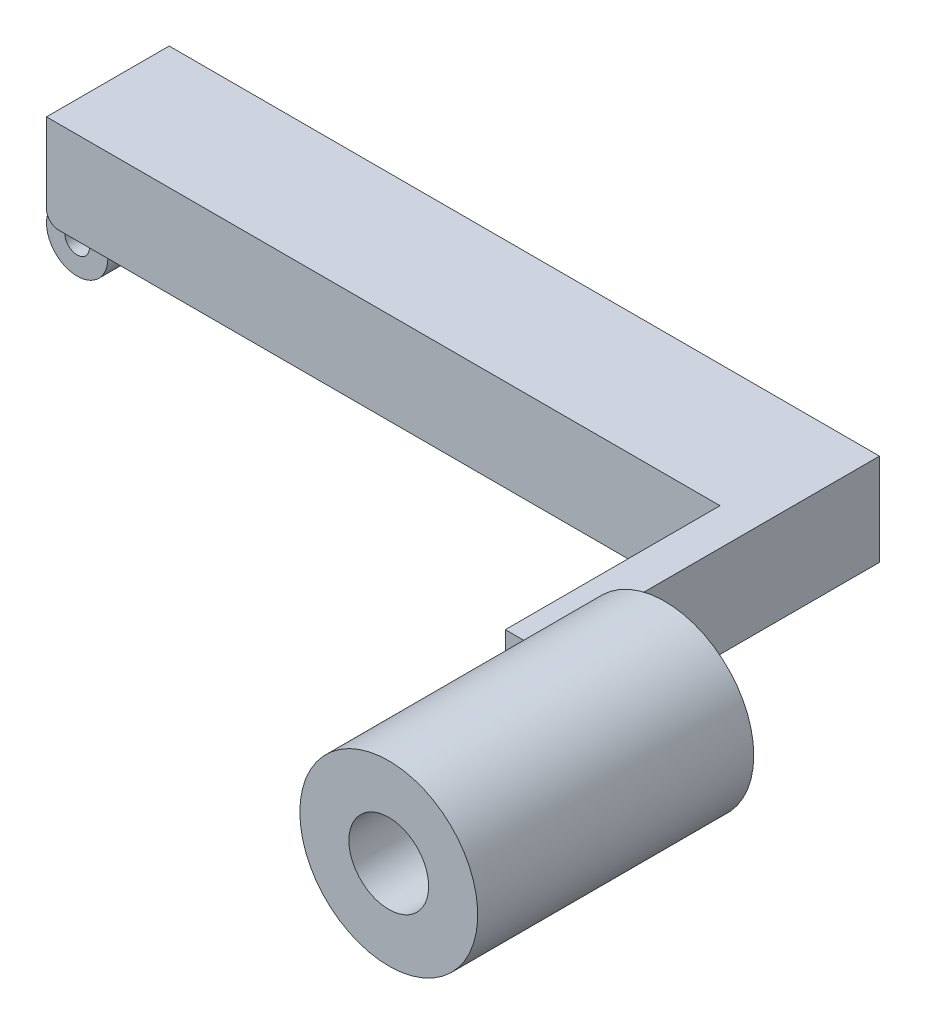
ISO-10303-21;
HEADER;
FILE_DESCRIPTION(('STEP AP214'),'2;1');
FILE_NAME('part.step','',(''),(''),'','','');
FILE_SCHEMA(('AUTOMOTIVE_DESIGN { 1 0 10303 214 1 1 1 1 }'));
ENDSEC;
DATA;
#1=APPLICATION_CONTEXT('core data for automotive mechanical design processes');
#2=APPLICATION_PROTOCOL_DEFINITION('international standard','automotive_design',2000,#1);
#3=PRODUCT_CONTEXT('',#1,'mechanical');
#4=PRODUCT('Part','Part','',(#3));
#5=PRODUCT_RELATED_PRODUCT_CATEGORY('part','',(#4));
#6=PRODUCT_DEFINITION_FORMATION('','',#4);
#7=PRODUCT_DEFINITION_CONTEXT('part definition',#1,'design');
#8=PRODUCT_DEFINITION('design','',#6,#7);
#9=PRODUCT_DEFINITION_SHAPE('','',#8);
#10=(LENGTH_UNIT() NAMED_UNIT(*) SI_UNIT(.MILLI.,.METRE.));
#11=(NAMED_UNIT(*) PLANE_ANGLE_UNIT() SI_UNIT($,.RADIAN.));
#12=(NAMED_UNIT(*) SI_UNIT($,.STERADIAN.) SOLID_ANGLE_UNIT());
#13=UNCERTAINTY_MEASURE_WITH_UNIT(LENGTH_MEASURE(1.E-05),#10,'distance_accuracy_value','');
#14=(GEOMETRIC_REPRESENTATION_CONTEXT(3) GLOBAL_UNCERTAINTY_ASSIGNED_CONTEXT((#13)) GLOBAL_UNIT_ASSIGNED_CONTEXT((#10,
#11,#12)) REPRESENTATION_CONTEXT('',''));
#15=CARTESIAN_POINT('',(0.,0.,0.));
#16=DIRECTION('',(0.,0.,1.));
#17=DIRECTION('',(1.,0.,0.));
#18=AXIS2_PLACEMENT_3D('',#15,#16,#17);
#19=CARTESIAN_POINT('',(0.,-12.5,5.));
#20=DIRECTION('',(0.,0.,-1.));
#21=DIRECTION('',(-1.,0.,0.));
#22=AXIS2_PLACEMENT_3D('',#19,#20,#21);
#23=CYLINDRICAL_SURFACE('',#22,2.);
#24=CARTESIAN_POINT('',(0.,-12.5,5.));
#25=DIRECTION('',(0.,0.,-1.));
#26=DIRECTION('',(-1.,0.,0.));
#27=AXIS2_PLACEMENT_3D('',#24,#25,#26);
#28=CIRCLE('',#27,2.);
#29=CARTESIAN_POINT('',(-2.,-12.5,5.));
#30=VERTEX_POINT('',#29);
#31=EDGE_CURVE('E179',#30,#30,#28,.T.);
#32=ORIENTED_EDGE('',*,*,#31,.F.);
#33=EDGE_LOOP('',(#32));
#34=FACE_BOUND('',#33,.T.);
#35=CARTESIAN_POINT('',(0.,-12.5,-5.));
#36=DIRECTION('',(0.,0.,-1.));
#37=DIRECTION('',(-1.,0.,0.));
#38=AXIS2_PLACEMENT_3D('',#35,#36,#37);
#39=CIRCLE('',#38,2.);
#40=CARTESIAN_POINT('',(-2.,-12.5,-5.));
#41=VERTEX_POINT('',#40);
#42=EDGE_CURVE('E20',#41,#41,#39,.T.);
#43=ORIENTED_EDGE('',*,*,#42,.T.);
#44=EDGE_LOOP('',(#43));
#45=FACE_BOUND('',#44,.T.);
#46=ADVANCED_FACE('F17',(#34,#45),#23,.F.);
#47=CARTESIAN_POINT('',(5.,-12.5,5.));
#48=DIRECTION('',(-1.,0.,0.));
#49=DIRECTION('',(0.,-1.,0.));
#50=AXIS2_PLACEMENT_3D('',#47,#48,#49);
#51=PLANE('',#50);
#52=DIRECTION('',(0.,0.,1.));
#53=VECTOR('',#52,1.);
#54=CARTESIAN_POINT('',(5.,-7.5,10.));
#55=LINE('',#54,#53);
#56=CARTESIAN_POINT('',(5.,-7.5,-5.));
#57=VERTEX_POINT('',#56);
#58=CARTESIAN_POINT('',(5.,-7.5,5.));
#59=VERTEX_POINT('',#58);
#60=EDGE_CURVE('E140',#57,#59,#55,.T.);
#61=ORIENTED_EDGE('',*,*,#60,.T.);
#62=DIRECTION('',(0.,1.,0.));
#63=VECTOR('',#62,1.);
#64=CARTESIAN_POINT('',(5.,-12.5,5.));
#65=LINE('',#64,#63);
#66=CARTESIAN_POINT('',(5.,-12.5,5.));
#67=VERTEX_POINT('',#66);
#68=EDGE_CURVE('E182',#67,#59,#65,.T.);
#69=ORIENTED_EDGE('',*,*,#68,.F.);
#70=DIRECTION('',(0.,0.,1.));
#71=VECTOR('',#70,1.);
#72=CARTESIAN_POINT('',(5.,-12.5,5.));
#73=LINE('',#72,#71);
#74=CARTESIAN_POINT('',(5.,-12.5,-5.));
#75=VERTEX_POINT('',#74);
#76=EDGE_CURVE('E121',#75,#67,#73,.T.);
#77=ORIENTED_EDGE('',*,*,#76,.F.);
#78=DIRECTION('',(0.,1.,0.));
#79=VECTOR('',#78,1.);
#80=CARTESIAN_POINT('',(5.,-12.5,-5.));
#81=LINE('',#80,#79);
#82=EDGE_CURVE('E106',#75,#57,#81,.T.);
#83=ORIENTED_EDGE('',*,*,#82,.T.);
#84=EDGE_LOOP('',(#61,#69,#77,#83));
#85=FACE_BOUND('',#84,.T.);
#86=ADVANCED_FACE('F302',(#85),#51,.F.);
#87=CARTESIAN_POINT('',(0.,-12.5,-5.));
#88=DIRECTION('',(0.,0.,1.));
#89=DIRECTION('',(1.,0.,0.));
#90=AXIS2_PLACEMENT_3D('',#87,#88,#89);
#91=PLANE('',#90);
#92=ORIENTED_EDGE('',*,*,#42,.F.);
#93=EDGE_LOOP('',(#92));
#94=FACE_BOUND('',#93,.T.);
#95=DIRECTION('',(0.,1.,0.));
#96=VECTOR('',#95,1.);
#97=CARTESIAN_POINT('',(0.,0.,-5.));
#98=LINE('',#97,#96);
#99=CARTESIAN_POINT('',(0.,-5.5,-5.));
#100=VERTEX_POINT('',#99);
#101=CARTESIAN_POINT('',(0.,-7.5,-5.));
#102=VERTEX_POINT('',#101);
#103=EDGE_CURVE('E89',#100,#102,#98,.F.);
#104=ORIENTED_EDGE('',*,*,#103,.F.);
#105=CARTESIAN_POINT('',(2.,-5.5,-5.));
#106=DIRECTION('',(0.,0.,1.));
#107=DIRECTION('',(1.,0.,0.));
#108=AXIS2_PLACEMENT_3D('',#105,#106,#107);
#109=CIRCLE('',#108,2.);
#110=CARTESIAN_POINT('',(2.00000000000002,-7.5,-5.));
#111=VERTEX_POINT('',#110);
#112=EDGE_CURVE('E143',#111,#100,#109,.F.);
#113=ORIENTED_EDGE('',*,*,#112,.F.);
#114=DIRECTION('',(1.,0.,0.));
#115=VECTOR('',#114,1.);
#116=CARTESIAN_POINT('',(115.8,-7.5,-5.));
#117=LINE('',#116,#115);
#118=EDGE_CURVE('E135',#111,#57,#117,.T.);
#119=ORIENTED_EDGE('',*,*,#118,.T.);
#120=ORIENTED_EDGE('',*,*,#82,.F.);
#121=CARTESIAN_POINT('',(0.,-12.5,-5.));
#122=DIRECTION('',(0.,0.,-1.));
#123=DIRECTION('',(-1.,0.,0.));
#124=AXIS2_PLACEMENT_3D('',#121,#122,#123);
#125=CIRCLE('',#124,5.);
#126=EDGE_CURVE('E102',#102,#75,#125,.F.);
#127=ORIENTED_EDGE('',*,*,#126,.F.);
#128=EDGE_LOOP('',(#104,#113,#119,#120,#127));
#129=FACE_BOUND('',#128,.T.);
#130=ADVANCED_FACE('F103',(#94,#129),#91,.F.);
#131=CARTESIAN_POINT('',(0.,-12.5,5.));
#132=DIRECTION('',(0.,0.,-1.));
#133=DIRECTION('',(-1.,0.,0.));
#134=AXIS2_PLACEMENT_3D('',#131,#132,#133);
#135=CYLINDRICAL_SURFACE('',#134,5.);
#136=DIRECTION('',(0.,0.,1.));
#137=VECTOR('',#136,1.);
#138=CARTESIAN_POINT('',(0.,-7.5,0.));
#139=LINE('',#138,#137);
#140=CARTESIAN_POINT('',(0.,-7.5,5.));
#141=VERTEX_POINT('',#140);
#142=EDGE_CURVE('E94',#102,#141,#139,.T.);
#143=ORIENTED_EDGE('',*,*,#142,.F.);
#144=ORIENTED_EDGE('',*,*,#126,.T.);
#145=ORIENTED_EDGE('',*,*,#76,.T.);
#146=CARTESIAN_POINT('',(0.,-12.5,5.));
#147=DIRECTION('',(0.,0.,-1.));
#148=DIRECTION('',(-1.,0.,0.));
#149=AXIS2_PLACEMENT_3D('',#146,#147,#148);
#150=CIRCLE('',#149,5.);
#151=EDGE_CURVE('E110',#141,#67,#150,.F.);
#152=ORIENTED_EDGE('',*,*,#151,.F.);
#153=EDGE_LOOP('',(#143,#144,#145,#152));
#154=FACE_BOUND('',#153,.T.);
#155=ADVANCED_FACE('F111',(#154),#135,.T.);
#156=CARTESIAN_POINT('',(0.,-12.5,5.));
#157=DIRECTION('',(0.,0.,1.));
#158=DIRECTION('',(1.,0.,0.));
#159=AXIS2_PLACEMENT_3D('',#156,#157,#158);
#160=PLANE('',#159);
#161=ORIENTED_EDGE('',*,*,#31,.T.);
#162=EDGE_LOOP('',(#161));
#163=FACE_BOUND('',#162,.T.);
#164=CARTESIAN_POINT('',(2.,-5.5,5.));
#165=DIRECTION('',(0.,0.,1.));
#166=DIRECTION('',(1.,0.,0.));
#167=AXIS2_PLACEMENT_3D('',#164,#165,#166);
#168=CIRCLE('',#167,2.);
#169=CARTESIAN_POINT('',(0.,-5.5,5.));
#170=VERTEX_POINT('',#169);
#171=CARTESIAN_POINT('',(2.,-7.5,5.));
#172=VERTEX_POINT('',#171);
#173=EDGE_CURVE('E177',#170,#172,#168,.T.);
#174=ORIENTED_EDGE('',*,*,#173,.F.);
#175=DIRECTION('',(0.,1.,0.));
#176=VECTOR('',#175,1.);
#177=CARTESIAN_POINT('',(0.,0.,5.));
#178=LINE('',#177,#176);
#179=EDGE_CURVE('E112',#141,#170,#178,.T.);
#180=ORIENTED_EDGE('',*,*,#179,.F.);
#181=ORIENTED_EDGE('',*,*,#151,.T.);
#182=ORIENTED_EDGE('',*,*,#68,.T.);
#183=DIRECTION('',(1.,0.,0.));
#184=VECTOR('',#183,1.);
#185=CARTESIAN_POINT('',(115.8,-7.5,5.));
#186=LINE('',#185,#184);
#187=EDGE_CURVE('E127',#59,#172,#186,.F.);
#188=ORIENTED_EDGE('',*,*,#187,.T.);
#189=EDGE_LOOP('',(#174,#180,#181,#182,#188));
#190=FACE_BOUND('',#189,.T.);
#191=ADVANCED_FACE('F335',(#163,#190),#160,.T.);
#192=CARTESIAN_POINT('',(2.,-5.5,10.));
#193=DIRECTION('',(0.,0.,1.));
#194=DIRECTION('',(1.,0.,0.));
#195=AXIS2_PLACEMENT_3D('',#192,#193,#194);
#196=CYLINDRICAL_SURFACE('',#195,2.);
#197=ORIENTED_EDGE('',*,*,#173,.T.);
#198=DIRECTION('',(0.,0.,1.));
#199=VECTOR('',#198,1.);
#200=CARTESIAN_POINT('',(2.,-7.5,10.));
#201=LINE('',#200,#199);
#202=CARTESIAN_POINT('',(2.,-7.5,10.));
#203=VERTEX_POINT('',#202);
#204=EDGE_CURVE('E124',#172,#203,#201,.T.);
#205=ORIENTED_EDGE('',*,*,#204,.T.);
#206=CARTESIAN_POINT('',(2.,-5.5,10.));
#207=DIRECTION('',(0.,0.,1.));
#208=DIRECTION('',(1.,0.,0.));
#209=AXIS2_PLACEMENT_3D('',#206,#207,#208);
#210=CIRCLE('',#209,2.);
#211=CARTESIAN_POINT('',(0.,-5.5,10.));
#212=VERTEX_POINT('',#211);
#213=EDGE_CURVE('E169',#203,#212,#210,.F.);
#214=ORIENTED_EDGE('',*,*,#213,.T.);
#215=DIRECTION('',(0.,0.,1.));
#216=VECTOR('',#215,1.);
#217=CARTESIAN_POINT('',(0.,-5.5,0.));
#218=LINE('',#217,#216);
#219=EDGE_CURVE('E114',#170,#212,#218,.T.);
#220=ORIENTED_EDGE('',*,*,#219,.F.);
#221=EDGE_LOOP('',(#197,#205,#214,#220));
#222=FACE_BOUND('',#221,.T.);
#223=ADVANCED_FACE('F336',(#222),#196,.T.);
#224=CARTESIAN_POINT('',(2.,-5.5,10.));
#225=DIRECTION('',(0.,0.,1.));
#226=DIRECTION('',(1.,0.,0.));
#227=AXIS2_PLACEMENT_3D('',#224,#225,#226);
#228=CYLINDRICAL_SURFACE('',#227,2.);
#229=CARTESIAN_POINT('',(2.,-5.5,-10.));
#230=DIRECTION('',(0.,0.,1.));
#231=DIRECTION('',(1.,0.,0.));
#232=AXIS2_PLACEMENT_3D('',#229,#230,#231);
#233=CIRCLE('',#232,2.);
#234=CARTESIAN_POINT('',(0.,-5.5,-10.));
#235=VERTEX_POINT('',#234);
#236=CARTESIAN_POINT('',(2.00000000000002,-7.5,-10.));
#237=VERTEX_POINT('',#236);
#238=EDGE_CURVE('E164',#235,#237,#233,.T.);
#239=ORIENTED_EDGE('',*,*,#238,.T.);
#240=DIRECTION('',(0.,0.,1.));
#241=VECTOR('',#240,1.);
#242=CARTESIAN_POINT('',(2.00000000000003,-7.5,10.));
#243=LINE('',#242,#241);
#244=EDGE_CURVE('E126',#237,#111,#243,.T.);
#245=ORIENTED_EDGE('',*,*,#244,.T.);
#246=ORIENTED_EDGE('',*,*,#112,.T.);
#247=DIRECTION('',(0.,0.,1.));
#248=VECTOR('',#247,1.);
#249=CARTESIAN_POINT('',(0.,-5.5,0.));
#250=LINE('',#249,#248);
#251=EDGE_CURVE('E97',#235,#100,#250,.T.);
#252=ORIENTED_EDGE('',*,*,#251,.F.);
#253=EDGE_LOOP('',(#239,#245,#246,#252));
#254=FACE_BOUND('',#253,.T.);
#255=ADVANCED_FACE('F304',(#254),#228,.T.);
#256=CARTESIAN_POINT('',(125.8,0.,80.));
#257=DIRECTION('',(0.,0.,-1.));
#258=DIRECTION('',(-1.,0.,0.));
#259=AXIS2_PLACEMENT_3D('',#256,#257,#258);
#260=CYLINDRICAL_SURFACE('',#259,6.50000000000002);
#261=CARTESIAN_POINT('',(125.8,0.,35.));
#262=DIRECTION('',(0.,0.,-1.));
#263=DIRECTION('',(-1.,0.,0.));
#264=AXIS2_PLACEMENT_3D('',#261,#262,#263);
#265=CIRCLE('',#264,6.50000000000002);
#266=CARTESIAN_POINT('',(119.3,0.,35.));
#267=VERTEX_POINT('',#266);
#268=EDGE_CURVE('E159',#267,#267,#265,.T.);
#269=ORIENTED_EDGE('',*,*,#268,.T.);
#270=EDGE_LOOP('',(#269));
#271=FACE_BOUND('',#270,.T.);
#272=CARTESIAN_POINT('',(125.8,0.,80.));
#273=DIRECTION('',(0.,0.,-1.));
#274=DIRECTION('',(-1.,0.,0.));
#275=AXIS2_PLACEMENT_3D('',#272,#273,#274);
#276=CIRCLE('',#275,6.50000000000002);
#277=CARTESIAN_POINT('',(119.3,0.,80.));
#278=VERTEX_POINT('',#277);
#279=EDGE_CURVE('E137',#278,#278,#276,.T.);
#280=ORIENTED_EDGE('',*,*,#279,.F.);
#281=EDGE_LOOP('',(#280));
#282=FACE_BOUND('',#281,.T.);
#283=ADVANCED_FACE('F344',(#271,#282),#260,.F.);
#284=CARTESIAN_POINT('',(115.8,-7.5,10.));
#285=DIRECTION('',(0.,1.,0.));
#286=DIRECTION('',(0.,0.,1.));
#287=AXIS2_PLACEMENT_3D('',#284,#285,#286);
#288=PLANE('',#287);
#289=ORIENTED_EDGE('',*,*,#244,.F.);
#290=DIRECTION('',(1.,0.,0.));
#291=VECTOR('',#290,1.);
#292=CARTESIAN_POINT('',(115.8,-7.5,-10.));
#293=LINE('',#292,#291);
#294=CARTESIAN_POINT('',(115.8,-7.5,-10.));
#295=VERTEX_POINT('',#294);
#296=EDGE_CURVE('E167',#237,#295,#293,.T.);
#297=ORIENTED_EDGE('',*,*,#296,.T.);
#298=DIRECTION('',(0.,0.,1.));
#299=VECTOR('',#298,1.);
#300=CARTESIAN_POINT('',(115.8,-7.5,0.));
#301=LINE('',#300,#299);
#302=CARTESIAN_POINT('',(115.8,-7.5,35.));
#303=VERTEX_POINT('',#302);
#304=EDGE_CURVE('E163',#295,#303,#301,.T.);
#305=ORIENTED_EDGE('',*,*,#304,.T.);
#306=DIRECTION('',(1.,0.,0.));
#307=VECTOR('',#306,1.);
#308=CARTESIAN_POINT('',(125.8,-7.5,35.));
#309=LINE('',#308,#307);
#310=CARTESIAN_POINT('',(113.390326354009,-7.5,35.));
#311=VERTEX_POINT('',#310);
#312=EDGE_CURVE('E162',#303,#311,#309,.F.);
#313=ORIENTED_EDGE('',*,*,#312,.T.);
#314=DIRECTION('',(0.,0.,-1.));
#315=VECTOR('',#314,1.);
#316=CARTESIAN_POINT('',(113.390326354009,-7.50000000000001,80.));
#317=LINE('',#316,#315);
#318=CARTESIAN_POINT('',(113.390326354009,-7.5,45.));
#319=VERTEX_POINT('',#318);
#320=EDGE_CURVE('E175',#319,#311,#317,.T.);
#321=ORIENTED_EDGE('',*,*,#320,.F.);
#322=DIRECTION('',(-1.,0.,0.));
#323=VECTOR('',#322,1.);
#324=CARTESIAN_POINT('',(0.,-7.5,45.));
#325=LINE('',#324,#323);
#326=CARTESIAN_POINT('',(109.8,-7.5,45.));
#327=VERTEX_POINT('',#326);
#328=EDGE_CURVE('E194',#319,#327,#325,.T.);
#329=ORIENTED_EDGE('',*,*,#328,.T.);
#330=DIRECTION('',(0.,0.,-1.));
#331=VECTOR('',#330,1.);
#332=CARTESIAN_POINT('',(109.8,-7.5,45.));
#333=LINE('',#332,#331);
#334=CARTESIAN_POINT('',(109.8,-7.5,10.));
#335=VERTEX_POINT('',#334);
#336=EDGE_CURVE('E128',#327,#335,#333,.T.);
#337=ORIENTED_EDGE('',*,*,#336,.T.);
#338=DIRECTION('',(-1.,0.,0.));
#339=VECTOR('',#338,1.);
#340=CARTESIAN_POINT('',(115.8,-7.5,10.));
#341=LINE('',#340,#339);
#342=EDGE_CURVE('E172',#335,#203,#341,.T.);
#343=ORIENTED_EDGE('',*,*,#342,.T.);
#344=ORIENTED_EDGE('',*,*,#204,.F.);
#345=ORIENTED_EDGE('',*,*,#187,.F.);
#346=ORIENTED_EDGE('',*,*,#60,.F.);
#347=ORIENTED_EDGE('',*,*,#118,.F.);
#348=EDGE_LOOP('',(#289,#297,#305,#313,#321,#329,#337,#343,#344,#345,#346,#347));
#349=FACE_BOUND('',#348,.T.);
#350=ADVANCED_FACE('F273',(#349),#288,.F.);
#351=CARTESIAN_POINT('',(125.8,0.,80.));
#352=DIRECTION('',(0.,0.,1.));
#353=DIRECTION('',(1.,0.,0.));
#354=AXIS2_PLACEMENT_3D('',#351,#352,#353);
#355=PLANE('',#354);
#356=ORIENTED_EDGE('',*,*,#279,.T.);
#357=EDGE_LOOP('',(#356));
#358=FACE_BOUND('',#357,.T.);
#359=CARTESIAN_POINT('',(125.8,0.,80.));
#360=DIRECTION('',(0.,0.,-1.));
#361=DIRECTION('',(-1.,0.,0.));
#362=AXIS2_PLACEMENT_3D('',#359,#360,#361);
#363=CIRCLE('',#362,14.5);
#364=CARTESIAN_POINT('',(111.3,0.,80.));
#365=VERTEX_POINT('',#364);
#366=EDGE_CURVE('E155',#365,#365,#363,.T.);
#367=ORIENTED_EDGE('',*,*,#366,.F.);
#368=EDGE_LOOP('',(#367));
#369=FACE_BOUND('',#368,.T.);
#370=ADVANCED_FACE('F369',(#358,#369),#355,.T.);
#371=CARTESIAN_POINT('',(0.,0.,45.));
#372=DIRECTION('',(0.,0.,-1.));
#373=DIRECTION('',(-1.,0.,0.));
#374=AXIS2_PLACEMENT_3D('',#371,#372,#373);
#375=PLANE('',#374);
#376=DIRECTION('',(1.,0.,0.));
#377=VECTOR('',#376,1.);
#378=CARTESIAN_POINT('',(115.8,7.5,45.));
#379=LINE('',#378,#377);
#380=CARTESIAN_POINT('',(113.390326354009,7.5,45.));
#381=VERTEX_POINT('',#380);
#382=CARTESIAN_POINT('',(109.8,7.5,45.));
#383=VERTEX_POINT('',#382);
#384=EDGE_CURVE('E153',#381,#383,#379,.F.);
#385=ORIENTED_EDGE('',*,*,#384,.T.);
#386=DIRECTION('',(0.,1.,0.));
#387=VECTOR('',#386,1.);
#388=CARTESIAN_POINT('',(109.8,7.5,45.));
#389=LINE('',#388,#387);
#390=EDGE_CURVE('E132',#383,#327,#389,.F.);
#391=ORIENTED_EDGE('',*,*,#390,.T.);
#392=ORIENTED_EDGE('',*,*,#328,.F.);
#393=CARTESIAN_POINT('',(125.8,0.,45.));
#394=DIRECTION('',(0.,0.,-1.));
#395=DIRECTION('',(-1.,0.,0.));
#396=AXIS2_PLACEMENT_3D('',#393,#394,#395);
#397=CIRCLE('',#396,14.5);
#398=EDGE_CURVE('E151',#381,#319,#397,.F.);
#399=ORIENTED_EDGE('',*,*,#398,.F.);
#400=EDGE_LOOP('',(#385,#391,#392,#399));
#401=FACE_BOUND('',#400,.T.);
#402=ADVANCED_FACE('F322',(#401),#375,.F.);
#403=CARTESIAN_POINT('',(109.8,7.5,45.));
#404=DIRECTION('',(1.,0.,0.));
#405=DIRECTION('',(0.,0.,-1.));
#406=AXIS2_PLACEMENT_3D('',#403,#404,#405);
#407=PLANE('',#406);
#408=ORIENTED_EDGE('',*,*,#336,.F.);
#409=ORIENTED_EDGE('',*,*,#390,.F.);
#410=DIRECTION('',(0.,0.,-1.));
#411=VECTOR('',#410,1.);
#412=CARTESIAN_POINT('',(109.8,7.5,10.));
#413=LINE('',#412,#411);
#414=CARTESIAN_POINT('',(109.8,7.5,10.));
#415=VERTEX_POINT('',#414);
#416=EDGE_CURVE('E208',#383,#415,#413,.T.);
#417=ORIENTED_EDGE('',*,*,#416,.T.);
#418=DIRECTION('',(0.,1.,0.));
#419=VECTOR('',#418,1.);
#420=CARTESIAN_POINT('',(109.8,-7.5,10.));
#421=LINE('',#420,#419);
#422=EDGE_CURVE('E131',#415,#335,#421,.F.);
#423=ORIENTED_EDGE('',*,*,#422,.T.);
#424=EDGE_LOOP('',(#408,#409,#417,#423));
#425=FACE_BOUND('',#424,.T.);
#426=ADVANCED_FACE('F326',(#425),#407,.F.);
#427=CARTESIAN_POINT('',(115.8,-7.5,10.));
#428=DIRECTION('',(0.,0.,-1.));
#429=DIRECTION('',(-1.,0.,0.));
#430=AXIS2_PLACEMENT_3D('',#427,#428,#429);
#431=PLANE('',#430);
#432=ORIENTED_EDGE('',*,*,#213,.F.);
#433=ORIENTED_EDGE('',*,*,#342,.F.);
#434=ORIENTED_EDGE('',*,*,#422,.F.);
#435=DIRECTION('',(1.,0.,0.));
#436=VECTOR('',#435,1.);
#437=CARTESIAN_POINT('',(115.8,7.5,10.));
#438=LINE('',#437,#436);
#439=CARTESIAN_POINT('',(0.,7.5,10.));
#440=VERTEX_POINT('',#439);
#441=EDGE_CURVE('E217',#415,#440,#438,.F.);
#442=ORIENTED_EDGE('',*,*,#441,.T.);
#443=DIRECTION('',(0.,1.,0.));
#444=VECTOR('',#443,1.);
#445=CARTESIAN_POINT('',(0.,0.,10.));
#446=LINE('',#445,#444);
#447=EDGE_CURVE('E189',#212,#440,#446,.T.);
#448=ORIENTED_EDGE('',*,*,#447,.F.);
#449=EDGE_LOOP('',(#432,#433,#434,#442,#448));
#450=FACE_BOUND('',#449,.T.);
#451=ADVANCED_FACE('F330',(#450),#431,.F.);
#452=CARTESIAN_POINT('',(0.,0.,0.));
#453=DIRECTION('',(-1.,0.,0.));
#454=DIRECTION('',(0.,0.,1.));
#455=AXIS2_PLACEMENT_3D('',#452,#453,#454);
#456=PLANE('',#455);
#457=ORIENTED_EDGE('',*,*,#447,.T.);
#458=DIRECTION('',(0.,0.,-1.));
#459=VECTOR('',#458,1.);
#460=CARTESIAN_POINT('',(0.,7.5,10.));
#461=LINE('',#460,#459);
#462=CARTESIAN_POINT('',(0.,7.5,-10.));
#463=VERTEX_POINT('',#462);
#464=EDGE_CURVE('E230',#440,#463,#461,.T.);
#465=ORIENTED_EDGE('',*,*,#464,.T.);
#466=DIRECTION('',(0.,1.,0.));
#467=VECTOR('',#466,1.);
#468=CARTESIAN_POINT('',(0.,-7.5,-10.));
#469=LINE('',#468,#467);
#470=EDGE_CURVE('E168',#463,#235,#469,.F.);
#471=ORIENTED_EDGE('',*,*,#470,.T.);
#472=ORIENTED_EDGE('',*,*,#251,.T.);
#473=ORIENTED_EDGE('',*,*,#103,.T.);
#474=ORIENTED_EDGE('',*,*,#142,.T.);
#475=ORIENTED_EDGE('',*,*,#179,.T.);
#476=ORIENTED_EDGE('',*,*,#219,.T.);
#477=EDGE_LOOP('',(#457,#465,#471,#472,#473,#474,#475,#476));
#478=FACE_BOUND('',#477,.T.);
#479=ADVANCED_FACE('F92',(#478),#456,.T.);
#480=CARTESIAN_POINT('',(115.8,-7.5,-10.));
#481=DIRECTION('',(0.,0.,1.));
#482=DIRECTION('',(1.,0.,0.));
#483=AXIS2_PLACEMENT_3D('',#480,#481,#482);
#484=PLANE('',#483);
#485=ORIENTED_EDGE('',*,*,#238,.F.);
#486=ORIENTED_EDGE('',*,*,#470,.F.);
#487=DIRECTION('',(1.,0.,0.));
#488=VECTOR('',#487,1.);
#489=CARTESIAN_POINT('',(115.8,7.5,-10.));
#490=LINE('',#489,#488);
#491=CARTESIAN_POINT('',(115.8,7.5,-10.));
#492=VERTEX_POINT('',#491);
#493=EDGE_CURVE('E238',#463,#492,#490,.T.);
#494=ORIENTED_EDGE('',*,*,#493,.T.);
#495=DIRECTION('',(0.,1.,0.));
#496=VECTOR('',#495,1.);
#497=CARTESIAN_POINT('',(115.8,0.,-10.));
#498=LINE('',#497,#496);
#499=EDGE_CURVE('E199',#492,#295,#498,.F.);
#500=ORIENTED_EDGE('',*,*,#499,.T.);
#501=ORIENTED_EDGE('',*,*,#296,.F.);
#502=EDGE_LOOP('',(#485,#486,#494,#500,#501));
#503=FACE_BOUND('',#502,.T.);
#504=ADVANCED_FACE('F308',(#503),#484,.F.);
#505=CARTESIAN_POINT('',(115.8,0.,0.));
#506=DIRECTION('',(-1.,0.,0.));
#507=DIRECTION('',(0.,0.,1.));
#508=AXIS2_PLACEMENT_3D('',#505,#506,#507);
#509=PLANE('',#508);
#510=ORIENTED_EDGE('',*,*,#304,.F.);
#511=ORIENTED_EDGE('',*,*,#499,.F.);
#512=DIRECTION('',(0.,0.,-1.));
#513=VECTOR('',#512,1.);
#514=CARTESIAN_POINT('',(115.8,7.5,10.));
#515=LINE('',#514,#513);
#516=CARTESIAN_POINT('',(115.8,7.5,35.));
#517=VERTEX_POINT('',#516);
#518=EDGE_CURVE('E250',#492,#517,#515,.F.);
#519=ORIENTED_EDGE('',*,*,#518,.T.);
#520=DIRECTION('',(0.,1.,0.));
#521=VECTOR('',#520,1.);
#522=CARTESIAN_POINT('',(115.8,0.,35.));
#523=LINE('',#522,#521);
#524=EDGE_CURVE('E158',#517,#303,#523,.F.);
#525=ORIENTED_EDGE('',*,*,#524,.T.);
#526=EDGE_LOOP('',(#510,#511,#519,#525));
#527=FACE_BOUND('',#526,.T.);
#528=ADVANCED_FACE('F312',(#527),#509,.F.);
#529=CARTESIAN_POINT('',(125.8,0.,35.));
#530=DIRECTION('',(0.,0.,1.));
#531=DIRECTION('',(1.,0.,0.));
#532=AXIS2_PLACEMENT_3D('',#529,#530,#531);
#533=PLANE('',#532);
#534=DIRECTION('',(1.,0.,0.));
#535=VECTOR('',#534,1.);
#536=CARTESIAN_POINT('',(115.8,7.5,35.));
#537=LINE('',#536,#535);
#538=CARTESIAN_POINT('',(113.390326354009,7.5,35.));
#539=VERTEX_POINT('',#538);
#540=EDGE_CURVE('E26',#517,#539,#537,.F.);
#541=ORIENTED_EDGE('',*,*,#540,.T.);
#542=CARTESIAN_POINT('',(125.8,0.,35.));
#543=DIRECTION('',(0.,0.,-1.));
#544=DIRECTION('',(-1.,0.,0.));
#545=AXIS2_PLACEMENT_3D('',#542,#543,#544);
#546=CIRCLE('',#545,14.5);
#547=EDGE_CURVE('E34',#311,#539,#546,.F.);
#548=ORIENTED_EDGE('',*,*,#547,.F.);
#549=ORIENTED_EDGE('',*,*,#312,.F.);
#550=ORIENTED_EDGE('',*,*,#524,.F.);
#551=EDGE_LOOP('',(#541,#548,#549,#550));
#552=FACE_BOUND('',#551,.T.);
#553=ORIENTED_EDGE('',*,*,#268,.F.);
#554=EDGE_LOOP('',(#553));
#555=FACE_BOUND('',#554,.T.);
#556=ADVANCED_FACE('F277',(#552,#555),#533,.F.);
#557=CARTESIAN_POINT('',(125.8,0.,80.));
#558=DIRECTION('',(0.,0.,-1.));
#559=DIRECTION('',(-1.,0.,0.));
#560=AXIS2_PLACEMENT_3D('',#557,#558,#559);
#561=CYLINDRICAL_SURFACE('',#560,14.5);
#562=ORIENTED_EDGE('',*,*,#320,.T.);
#563=ORIENTED_EDGE('',*,*,#547,.T.);
#564=DIRECTION('',(0.,0.,-1.));
#565=VECTOR('',#564,1.);
#566=CARTESIAN_POINT('',(113.390326354009,7.5,10.));
#567=LINE('',#566,#565);
#568=EDGE_CURVE('E11',#539,#381,#567,.F.);
#569=ORIENTED_EDGE('',*,*,#568,.T.);
#570=ORIENTED_EDGE('',*,*,#398,.T.);
#571=EDGE_LOOP('',(#562,#563,#569,#570));
#572=FACE_BOUND('',#571,.T.);
#573=ORIENTED_EDGE('',*,*,#366,.T.);
#574=EDGE_LOOP('',(#573));
#575=FACE_BOUND('',#574,.T.);
#576=ADVANCED_FACE('F319',(#572,#575),#561,.T.);
#577=CARTESIAN_POINT('',(115.8,7.5,10.));
#578=DIRECTION('',(0.,-1.,0.));
#579=DIRECTION('',(0.,0.,-1.));
#580=AXIS2_PLACEMENT_3D('',#577,#578,#579);
#581=PLANE('',#580);
#582=ORIENTED_EDGE('',*,*,#540,.F.);
#583=ORIENTED_EDGE('',*,*,#518,.F.);
#584=ORIENTED_EDGE('',*,*,#493,.F.);
#585=ORIENTED_EDGE('',*,*,#464,.F.);
#586=ORIENTED_EDGE('',*,*,#441,.F.);
#587=ORIENTED_EDGE('',*,*,#416,.F.);
#588=ORIENTED_EDGE('',*,*,#384,.F.);
#589=ORIENTED_EDGE('',*,*,#568,.F.);
#590=EDGE_LOOP('',(#582,#583,#584,#585,#586,#587,#588,#589));
#591=FACE_BOUND('',#590,.T.);
#592=ADVANCED_FACE('F314',(#591),#581,.F.);
#593=CLOSED_SHELL('',(#46,#86,#130,#155,#191,#223,#255,#283,#350,#370,#402,#426,#451,#479,#504,
#528,#556,#576,#592));
#594=MANIFOLD_SOLID_BREP('B1',#593);
#595=ADVANCED_BREP_SHAPE_REPRESENTATION('',(#18,#594),#14);
#596=SHAPE_DEFINITION_REPRESENTATION(#9,#595);
ENDSEC;
END-ISO-10303-21;
